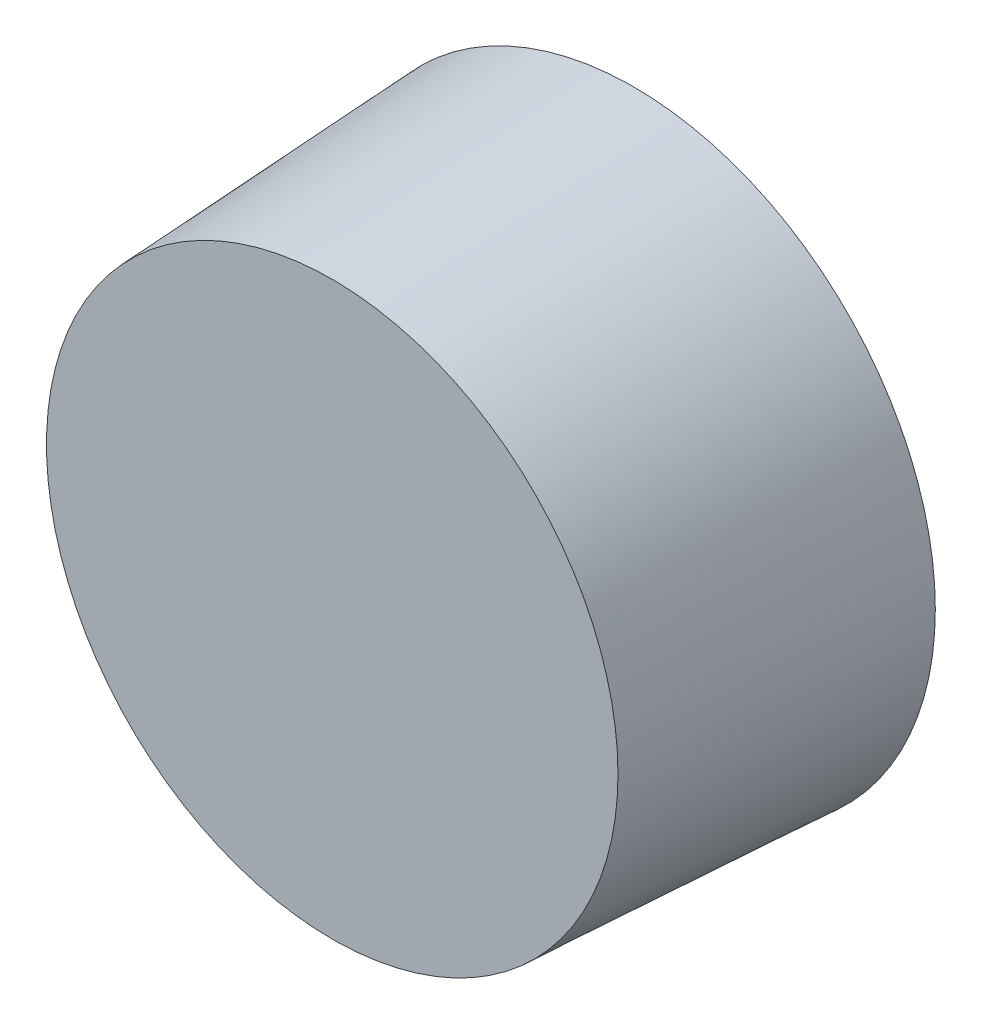
ISO-10303-21;
HEADER;
FILE_DESCRIPTION(('STEP AP214'),'2;1');
FILE_NAME('part.step','',(''),(''),'','','');
FILE_SCHEMA(('AUTOMOTIVE_DESIGN { 1 0 10303 214 1 1 1 1 }'));
ENDSEC;
DATA;
#1=APPLICATION_CONTEXT('core data for automotive mechanical design processes');
#2=APPLICATION_PROTOCOL_DEFINITION('international standard','automotive_design',2000,#1);
#3=PRODUCT_CONTEXT('',#1,'mechanical');
#4=PRODUCT('Part','Part','',(#3));
#5=PRODUCT_RELATED_PRODUCT_CATEGORY('part','',(#4));
#6=PRODUCT_DEFINITION_FORMATION('','',#4);
#7=PRODUCT_DEFINITION_CONTEXT('part definition',#1,'design');
#8=PRODUCT_DEFINITION('design','',#6,#7);
#9=PRODUCT_DEFINITION_SHAPE('','',#8);
#10=(LENGTH_UNIT() NAMED_UNIT(*) SI_UNIT(.MILLI.,.METRE.));
#11=(NAMED_UNIT(*) PLANE_ANGLE_UNIT() SI_UNIT($,.RADIAN.));
#12=(NAMED_UNIT(*) SI_UNIT($,.STERADIAN.) SOLID_ANGLE_UNIT());
#13=UNCERTAINTY_MEASURE_WITH_UNIT(LENGTH_MEASURE(1.E-05),#10,'distance_accuracy_value','');
#14=(GEOMETRIC_REPRESENTATION_CONTEXT(3) GLOBAL_UNCERTAINTY_ASSIGNED_CONTEXT((#13)) GLOBAL_UNIT_ASSIGNED_CONTEXT((#10,
#11,#12)) REPRESENTATION_CONTEXT('',''));
#15=CARTESIAN_POINT('',(0.,0.,0.));
#16=DIRECTION('',(0.,0.,1.));
#17=DIRECTION('',(1.,0.,0.));
#18=AXIS2_PLACEMENT_3D('',#15,#16,#17);
#19=CARTESIAN_POINT('',(0.,0.,0.));
#20=DIRECTION('',(0.,0.,-1.));
#21=DIRECTION('',(1.,0.,0.));
#22=AXIS2_PLACEMENT_3D('',#19,#20,#21);
#23=CONICAL_SURFACE('',#22,50.,0.05235987755983);
#24=CARTESIAN_POINT('',(0.,0.,50.));
#25=DIRECTION('',(0.,0.,1.));
#26=DIRECTION('',(1.,0.,0.));
#27=AXIS2_PLACEMENT_3D('',#24,#25,#26);
#28=CIRCLE('',#27,47.3796110358479);
#29=CARTESIAN_POINT('',(47.3796110358479,0.,50.));
#30=VERTEX_POINT('',#29);
#31=EDGE_CURVE('E10',#30,#30,#28,.T.);
#32=ORIENTED_EDGE('',*,*,#31,.F.);
#33=EDGE_LOOP('',(#32));
#34=FACE_BOUND('',#33,.T.);
#35=CARTESIAN_POINT('',(0.,0.,0.));
#36=DIRECTION('',(0.,0.,1.));
#37=DIRECTION('',(1.,0.,0.));
#38=AXIS2_PLACEMENT_3D('',#35,#36,#37);
#39=CIRCLE('',#38,50.);
#40=CARTESIAN_POINT('',(50.,0.,0.));
#41=VERTEX_POINT('',#40);
#42=EDGE_CURVE('E35',#41,#41,#39,.T.);
#43=ORIENTED_EDGE('',*,*,#42,.T.);
#44=EDGE_LOOP('',(#43));
#45=FACE_BOUND('',#44,.T.);
#46=ADVANCED_FACE('F29',(#34,#45),#23,.T.);
#47=CARTESIAN_POINT('',(0.,0.,50.));
#48=DIRECTION('',(0.,0.,1.));
#49=DIRECTION('',(1.,0.,0.));
#50=AXIS2_PLACEMENT_3D('',#47,#48,#49);
#51=PLANE('',#50);
#52=ORIENTED_EDGE('',*,*,#31,.T.);
#53=EDGE_LOOP('',(#52));
#54=FACE_BOUND('',#53,.T.);
#55=ADVANCED_FACE('F54',(#54),#51,.T.);
#56=CARTESIAN_POINT('',(0.,0.,0.));
#57=DIRECTION('',(0.,0.,1.));
#58=DIRECTION('',(1.,0.,0.));
#59=AXIS2_PLACEMENT_3D('',#56,#57,#58);
#60=PLANE('',#59);
#61=CARTESIAN_POINT('',(0.,0.,0.));
#62=DIRECTION('',(0.,0.,-1.));
#63=DIRECTION('',(-1.,0.,0.));
#64=AXIS2_PLACEMENT_3D('',#61,#62,#63);
#65=CIRCLE('',#64,40.);
#66=CARTESIAN_POINT('',(-40.,0.,0.));
#67=VERTEX_POINT('',#66);
#68=EDGE_CURVE('E43',#67,#67,#65,.T.);
#69=ORIENTED_EDGE('',*,*,#68,.F.);
#70=EDGE_LOOP('',(#69));
#71=FACE_BOUND('',#70,.T.);
#72=ORIENTED_EDGE('',*,*,#42,.F.);
#73=EDGE_LOOP('',(#72));
#74=FACE_BOUND('',#73,.T.);
#75=ADVANCED_FACE('F51',(#71,#74),#60,.F.);
#76=CARTESIAN_POINT('',(0.,0.,0.));
#77=DIRECTION('',(0.,0.,-1.));
#78=DIRECTION('',(-1.,0.,0.));
#79=AXIS2_PLACEMENT_3D('',#76,#77,#78);
#80=CONICAL_SURFACE('',#79,40.,0.0174532925199433);
#81=CARTESIAN_POINT('',(0.,0.,20.));
#82=DIRECTION('',(0.,0.,-1.));
#83=DIRECTION('',(-1.,0.,0.));
#84=AXIS2_PLACEMENT_3D('',#81,#82,#83);
#85=CIRCLE('',#84,39.6508987014356);
#86=CARTESIAN_POINT('',(-39.6508987014356,0.,20.));
#87=VERTEX_POINT('',#86);
#88=EDGE_CURVE('E39',#87,#87,#85,.T.);
#89=ORIENTED_EDGE('',*,*,#88,.F.);
#90=EDGE_LOOP('',(#89));
#91=FACE_BOUND('',#90,.T.);
#92=ORIENTED_EDGE('',*,*,#68,.T.);
#93=EDGE_LOOP('',(#92));
#94=FACE_BOUND('',#93,.T.);
#95=ADVANCED_FACE('F49',(#91,#94),#80,.F.);
#96=CARTESIAN_POINT('',(0.,0.,20.));
#97=DIRECTION('',(0.,0.,-1.));
#98=DIRECTION('',(-1.,0.,0.));
#99=AXIS2_PLACEMENT_3D('',#96,#97,#98);
#100=PLANE('',#99);
#101=ORIENTED_EDGE('',*,*,#88,.T.);
#102=EDGE_LOOP('',(#101));
#103=FACE_BOUND('',#102,.T.);
#104=ADVANCED_FACE('F59',(#103),#100,.T.);
#105=CLOSED_SHELL('',(#46,#55,#75,#95,#104));
#106=MANIFOLD_SOLID_BREP('B2',#105);
#107=ADVANCED_BREP_SHAPE_REPRESENTATION('',(#18,#106),#14);
#108=SHAPE_DEFINITION_REPRESENTATION(#9,#107);
ENDSEC;
END-ISO-10303-21;
